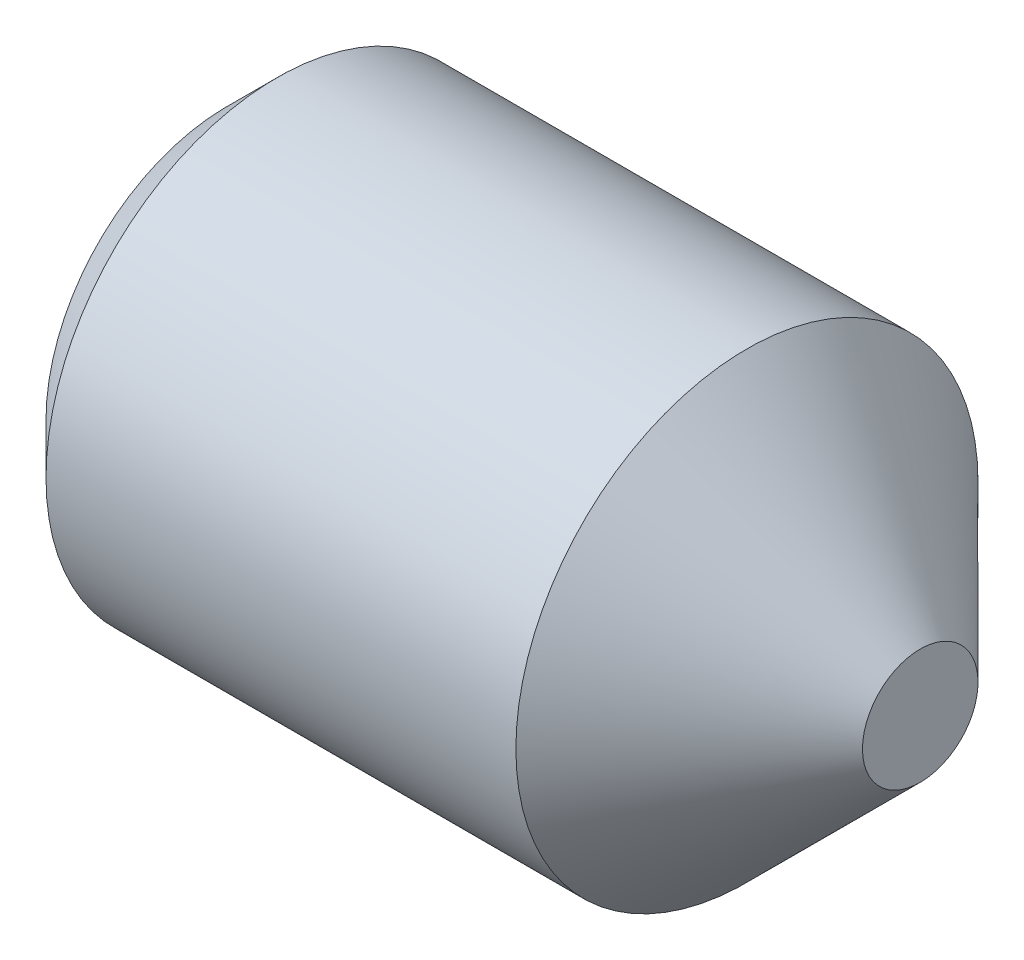
ISO-10303-21;
HEADER;
FILE_DESCRIPTION(('STEP AP214'),'2;1');
FILE_NAME('part.step','',(''),(''),'','','');
FILE_SCHEMA(('AUTOMOTIVE_DESIGN { 1 0 10303 214 1 1 1 1 }'));
ENDSEC;
DATA;
#1=APPLICATION_CONTEXT('core data for automotive mechanical design processes');
#2=APPLICATION_PROTOCOL_DEFINITION('international standard','automotive_design',2000,#1);
#3=PRODUCT_CONTEXT('',#1,'mechanical');
#4=PRODUCT('Part','Part','',(#3));
#5=PRODUCT_RELATED_PRODUCT_CATEGORY('part','',(#4));
#6=PRODUCT_DEFINITION_FORMATION('','',#4);
#7=PRODUCT_DEFINITION_CONTEXT('part definition',#1,'design');
#8=PRODUCT_DEFINITION('design','',#6,#7);
#9=PRODUCT_DEFINITION_SHAPE('','',#8);
#10=(LENGTH_UNIT() NAMED_UNIT(*) SI_UNIT(.MILLI.,.METRE.));
#11=(NAMED_UNIT(*) PLANE_ANGLE_UNIT() SI_UNIT($,.RADIAN.));
#12=(NAMED_UNIT(*) SI_UNIT($,.STERADIAN.) SOLID_ANGLE_UNIT());
#13=UNCERTAINTY_MEASURE_WITH_UNIT(LENGTH_MEASURE(1.E-05),#10,'distance_accuracy_value','');
#14=(GEOMETRIC_REPRESENTATION_CONTEXT(3) GLOBAL_UNCERTAINTY_ASSIGNED_CONTEXT((#13)) GLOBAL_UNIT_ASSIGNED_CONTEXT((#10,
#11,#12)) REPRESENTATION_CONTEXT('',''));
#15=CARTESIAN_POINT('',(0.,0.,0.));
#16=DIRECTION('',(0.,0.,1.));
#17=DIRECTION('',(1.,0.,0.));
#18=AXIS2_PLACEMENT_3D('',#15,#16,#17);
#19=CARTESIAN_POINT('',(0.799999999886313,0.,0.519615242270663));
#20=DIRECTION('',(-1.,0.,0.));
#21=DIRECTION('',(0.,0.,1.));
#22=AXIS2_PLACEMENT_3D('',#19,#20,#21);
#23=PLANE('',#22);
#24=DIRECTION('',(0.,0.,-1.));
#25=VECTOR('',#24,1.);
#26=CARTESIAN_POINT('',(0.799999999886313,0.45,0.259807621135332));
#27=LINE('',#26,#25);
#28=CARTESIAN_POINT('',(0.799999999886313,0.45,0.259807621135332));
#29=VERTEX_POINT('',#28);
#30=CARTESIAN_POINT('',(0.799999999886313,0.45,0.));
#31=VERTEX_POINT('',#30);
#32=EDGE_CURVE('E158',#29,#31,#27,.T.);
#33=ORIENTED_EDGE('',*,*,#32,.T.);
#34=CARTESIAN_POINT('',(0.799999999886313,0.,0.));
#35=DIRECTION('',(1.,0.,0.));
#36=DIRECTION('',(0.,1.,0.));
#37=AXIS2_PLACEMENT_3D('',#34,#35,#36);
#38=CIRCLE('',#37,0.45);
#39=CARTESIAN_POINT('',(0.799999999886313,0.225,0.389711431702997));
#40=VERTEX_POINT('',#39);
#41=EDGE_CURVE('E47',#31,#40,#38,.T.);
#42=ORIENTED_EDGE('',*,*,#41,.T.);
#43=DIRECTION('',(0.,0.866025403784438,-0.5));
#44=VECTOR('',#43,1.);
#45=CARTESIAN_POINT('',(0.799999999886313,0.,0.519615242270663));
#46=LINE('',#45,#44);
#47=EDGE_CURVE('E214',#40,#29,#46,.T.);
#48=ORIENTED_EDGE('',*,*,#47,.T.);
#49=EDGE_LOOP('',(#33,#42,#48));
#50=FACE_BOUND('',#49,.T.);
#51=ADVANCED_FACE('F36',(#50),#23,.T.);
#52=CARTESIAN_POINT('',(0.799999999886313,0.,0.519615242270663));
#53=VERTEX_POINT('',#52);
#54=EDGE_CURVE('E219',#53,#40,#46,.T.);
#55=ORIENTED_EDGE('',*,*,#54,.T.);
#56=CARTESIAN_POINT('',(0.799999999886313,-0.225,0.389711431702997));
#57=VERTEX_POINT('',#56);
#58=EDGE_CURVE('E11',#40,#57,#38,.T.);
#59=ORIENTED_EDGE('',*,*,#58,.T.);
#60=DIRECTION('',(0.,0.866025403784438,0.5));
#61=VECTOR('',#60,1.);
#62=CARTESIAN_POINT('',(0.799999999886313,-0.45,0.259807621135332));
#63=LINE('',#62,#61);
#64=EDGE_CURVE('E184',#57,#53,#63,.T.);
#65=ORIENTED_EDGE('',*,*,#64,.T.);
#66=EDGE_LOOP('',(#55,#59,#65));
#67=FACE_BOUND('',#66,.T.);
#68=ADVANCED_FACE('F123',(#67),#23,.T.);
#69=CARTESIAN_POINT('',(0.799999999886313,-0.45,0.259807621135332));
#70=VERTEX_POINT('',#69);
#71=EDGE_CURVE('E220',#70,#57,#63,.T.);
#72=ORIENTED_EDGE('',*,*,#71,.T.);
#73=CARTESIAN_POINT('',(0.799999999886313,-0.45,0.));
#74=VERTEX_POINT('',#73);
#75=EDGE_CURVE('E45',#57,#74,#38,.T.);
#76=ORIENTED_EDGE('',*,*,#75,.T.);
#77=DIRECTION('',(0.,0.,1.));
#78=VECTOR('',#77,1.);
#79=CARTESIAN_POINT('',(0.799999999886313,-0.45,-0.259807621135331));
#80=LINE('',#79,#78);
#81=EDGE_CURVE('E163',#74,#70,#80,.T.);
#82=ORIENTED_EDGE('',*,*,#81,.T.);
#83=EDGE_LOOP('',(#72,#76,#82));
#84=FACE_BOUND('',#83,.T.);
#85=ADVANCED_FACE('F129',(#84),#23,.T.);
#86=CARTESIAN_POINT('',(0.799999999886313,-0.45,-0.259807621135331));
#87=VERTEX_POINT('',#86);
#88=EDGE_CURVE('E164',#87,#74,#80,.T.);
#89=ORIENTED_EDGE('',*,*,#88,.T.);
#90=CARTESIAN_POINT('',(0.799999999886313,-0.225,-0.389711431702997));
#91=VERTEX_POINT('',#90);
#92=EDGE_CURVE('E211',#74,#91,#38,.T.);
#93=ORIENTED_EDGE('',*,*,#92,.T.);
#94=DIRECTION('',(0.,-0.866025403784439,0.5));
#95=VECTOR('',#94,1.);
#96=CARTESIAN_POINT('',(0.799999999886313,0.,-0.519615242270663));
#97=LINE('',#96,#95);
#98=EDGE_CURVE('E153',#91,#87,#97,.T.);
#99=ORIENTED_EDGE('',*,*,#98,.T.);
#100=EDGE_LOOP('',(#89,#93,#99));
#101=FACE_BOUND('',#100,.T.);
#102=ADVANCED_FACE('F142',(#101),#23,.T.);
#103=CARTESIAN_POINT('',(0.799999999886313,0.,-0.519615242270663));
#104=VERTEX_POINT('',#103);
#105=EDGE_CURVE('E156',#104,#91,#97,.T.);
#106=ORIENTED_EDGE('',*,*,#105,.T.);
#107=CARTESIAN_POINT('',(0.799999999886313,0.225,-0.389711431702997));
#108=VERTEX_POINT('',#107);
#109=EDGE_CURVE('E209',#91,#108,#38,.T.);
#110=ORIENTED_EDGE('',*,*,#109,.T.);
#111=DIRECTION('',(0.,-0.866025403784438,-0.5));
#112=VECTOR('',#111,1.);
#113=CARTESIAN_POINT('',(0.799999999886313,0.45,-0.259807621135332));
#114=LINE('',#113,#112);
#115=EDGE_CURVE('E154',#108,#104,#114,.T.);
#116=ORIENTED_EDGE('',*,*,#115,.T.);
#117=EDGE_LOOP('',(#106,#110,#116));
#118=FACE_BOUND('',#117,.T.);
#119=ADVANCED_FACE('F134',(#118),#23,.T.);
#120=CARTESIAN_POINT('',(0.799999999886313,0.45,-0.259807621135332));
#121=VERTEX_POINT('',#120);
#122=EDGE_CURVE('E146',#121,#108,#114,.T.);
#123=ORIENTED_EDGE('',*,*,#122,.T.);
#124=EDGE_CURVE('E147',#108,#31,#38,.T.);
#125=ORIENTED_EDGE('',*,*,#124,.T.);
#126=EDGE_CURVE('E149',#31,#121,#27,.T.);
#127=ORIENTED_EDGE('',*,*,#126,.T.);
#128=EDGE_LOOP('',(#123,#125,#127));
#129=FACE_BOUND('',#128,.T.);
#130=ADVANCED_FACE('F125',(#129),#23,.T.);
#131=CARTESIAN_POINT('',(0.,0.7835,0.));
#132=DIRECTION('',(1.,0.,0.));
#133=DIRECTION('',(0.,0.,-1.));
#134=AXIS2_PLACEMENT_3D('',#131,#132,#133);
#135=PLANE('',#134);
#136=DIRECTION('',(0.,0.866025403784438,-0.5));
#137=VECTOR('',#136,1.);
#138=CARTESIAN_POINT('',(-1.13686837721616E-10,0.,0.519615242270663));
#139=LINE('',#138,#137);
#140=CARTESIAN_POINT('',(0.,0.,0.519615242270663));
#141=VERTEX_POINT('',#140);
#142=CARTESIAN_POINT('',(-1.13686837721616E-10,0.45,0.259807621135332));
#143=VERTEX_POINT('',#142);
#144=EDGE_CURVE('E169',#141,#143,#139,.T.);
#145=ORIENTED_EDGE('',*,*,#144,.F.);
#146=DIRECTION('',(0.,0.866025403784438,0.5));
#147=VECTOR('',#146,1.);
#148=CARTESIAN_POINT('',(-1.13686837721616E-10,-0.45,0.259807621135332));
#149=LINE('',#148,#147);
#150=CARTESIAN_POINT('',(-1.13686837721616E-10,-0.45,0.259807621135332));
#151=VERTEX_POINT('',#150);
#152=EDGE_CURVE('E61',#151,#141,#149,.T.);
#153=ORIENTED_EDGE('',*,*,#152,.F.);
#154=DIRECTION('',(0.,0.,1.));
#155=VECTOR('',#154,1.);
#156=CARTESIAN_POINT('',(-1.13686837721616E-10,-0.45,-0.259807621135331));
#157=LINE('',#156,#155);
#158=CARTESIAN_POINT('',(-1.13686837721616E-10,-0.45,-0.259807621135331));
#159=VERTEX_POINT('',#158);
#160=EDGE_CURVE('E181',#159,#151,#157,.T.);
#161=ORIENTED_EDGE('',*,*,#160,.F.);
#162=DIRECTION('',(0.,-0.866025403784439,0.5));
#163=VECTOR('',#162,1.);
#164=CARTESIAN_POINT('',(-1.13686837721616E-10,0.,-0.519615242270663));
#165=LINE('',#164,#163);
#166=CARTESIAN_POINT('',(-1.13686837721616E-10,0.,-0.519615242270663));
#167=VERTEX_POINT('',#166);
#168=EDGE_CURVE('E178',#167,#159,#165,.T.);
#169=ORIENTED_EDGE('',*,*,#168,.F.);
#170=DIRECTION('',(0.,-0.866025403784438,-0.5));
#171=VECTOR('',#170,1.);
#172=CARTESIAN_POINT('',(-1.13686837721616E-10,0.45,-0.259807621135332));
#173=LINE('',#172,#171);
#174=CARTESIAN_POINT('',(-1.13686837721616E-10,0.45,-0.259807621135332));
#175=VERTEX_POINT('',#174);
#176=EDGE_CURVE('E175',#175,#167,#173,.T.);
#177=ORIENTED_EDGE('',*,*,#176,.F.);
#178=DIRECTION('',(0.,0.,-1.));
#179=VECTOR('',#178,1.);
#180=CARTESIAN_POINT('',(-1.13686837721616E-10,0.45,0.259807621135332));
#181=LINE('',#180,#179);
#182=EDGE_CURVE('E172',#143,#175,#181,.T.);
#183=ORIENTED_EDGE('',*,*,#182,.F.);
#184=EDGE_LOOP('',(#145,#153,#161,#169,#177,#183));
#185=FACE_BOUND('',#184,.T.);
#186=CARTESIAN_POINT('',(0.,0.,0.));
#187=DIRECTION('',(-1.,0.,0.));
#188=DIRECTION('',(0.,0.,1.));
#189=AXIS2_PLACEMENT_3D('',#186,#187,#188);
#190=CIRCLE('',#189,0.7835);
#191=CARTESIAN_POINT('',(0.,0.,0.7835));
#192=VERTEX_POINT('',#191);
#193=EDGE_CURVE('E187',#192,#192,#190,.T.);
#194=ORIENTED_EDGE('',*,*,#193,.T.);
#195=EDGE_LOOP('',(#194));
#196=FACE_BOUND('',#195,.T.);
#197=ADVANCED_FACE('F38',(#185,#196),#135,.F.);
#198=CARTESIAN_POINT('',(3.,0.,0.));
#199=DIRECTION('',(-1.,0.,0.));
#200=DIRECTION('',(0.,0.,1.));
#201=AXIS2_PLACEMENT_3D('',#198,#199,#200);
#202=PLANE('',#201);
#203=CARTESIAN_POINT('',(3.,0.,0.));
#204=DIRECTION('',(-1.,0.,0.));
#205=DIRECTION('',(0.,0.,1.));
#206=AXIS2_PLACEMENT_3D('',#203,#204,#205);
#207=CIRCLE('',#206,0.25);
#208=CARTESIAN_POINT('',(3.,0.,0.25));
#209=VERTEX_POINT('',#208);
#210=EDGE_CURVE('E40',#209,#209,#207,.T.);
#211=ORIENTED_EDGE('',*,*,#210,.F.);
#212=EDGE_LOOP('',(#211));
#213=FACE_BOUND('',#212,.T.);
#214=ADVANCED_FACE('F140',(#213),#202,.F.);
#215=CARTESIAN_POINT('',(3.,0.,0.));
#216=DIRECTION('',(-1.,0.,0.));
#217=DIRECTION('',(0.,0.,1.));
#218=AXIS2_PLACEMENT_3D('',#215,#216,#217);
#219=CONICAL_SURFACE('',#218,0.25,0.785398163397443);
#220=CARTESIAN_POINT('',(2.24999999999999,0.,0.));
#221=DIRECTION('',(-1.,0.,0.));
#222=DIRECTION('',(0.,0.,1.));
#223=AXIS2_PLACEMENT_3D('',#220,#221,#222);
#224=CIRCLE('',#223,1.);
#225=CARTESIAN_POINT('',(2.24999999999999,0.,1.));
#226=VERTEX_POINT('',#225);
#227=EDGE_CURVE('E202',#226,#226,#224,.T.);
#228=ORIENTED_EDGE('',*,*,#227,.F.);
#229=EDGE_LOOP('',(#228));
#230=FACE_BOUND('',#229,.T.);
#231=ORIENTED_EDGE('',*,*,#210,.T.);
#232=EDGE_LOOP('',(#231));
#233=FACE_BOUND('',#232,.T.);
#234=ADVANCED_FACE('F267',(#230,#233),#219,.T.);
#235=CARTESIAN_POINT('',(-14.774129749189,0.,0.));
#236=DIRECTION('',(-1.,0.,0.));
#237=DIRECTION('',(0.,0.,1.));
#238=AXIS2_PLACEMENT_3D('',#235,#236,#237);
#239=CYLINDRICAL_SURFACE('',#238,1.);
#240=CARTESIAN_POINT('',(0.216500000000001,0.,0.));
#241=DIRECTION('',(-1.,0.,0.));
#242=DIRECTION('',(0.,0.,1.));
#243=AXIS2_PLACEMENT_3D('',#240,#241,#242);
#244=CIRCLE('',#243,1.);
#245=CARTESIAN_POINT('',(0.216500000000001,0.,1.));
#246=VERTEX_POINT('',#245);
#247=EDGE_CURVE('E200',#246,#246,#244,.T.);
#248=ORIENTED_EDGE('',*,*,#247,.F.);
#249=EDGE_LOOP('',(#248));
#250=FACE_BOUND('',#249,.T.);
#251=ORIENTED_EDGE('',*,*,#227,.T.);
#252=EDGE_LOOP('',(#251));
#253=FACE_BOUND('',#252,.T.);
#254=ADVANCED_FACE('F263',(#250,#253),#239,.T.);
#255=CARTESIAN_POINT('',(0.216500000000001,0.,0.));
#256=DIRECTION('',(1.,0.,0.));
#257=DIRECTION('',(0.,0.,-1.));
#258=AXIS2_PLACEMENT_3D('',#255,#256,#257);
#259=CONICAL_SURFACE('',#258,1.,0.785398163397445);
#260=ORIENTED_EDGE('',*,*,#193,.F.);
#261=EDGE_LOOP('',(#260));
#262=FACE_BOUND('',#261,.T.);
#263=ORIENTED_EDGE('',*,*,#247,.T.);
#264=EDGE_LOOP('',(#263));
#265=FACE_BOUND('',#264,.T.);
#266=ADVANCED_FACE('F254',(#262,#265),#259,.T.);
#267=CARTESIAN_POINT('',(0.799999999886313,-0.45,0.259807621135332));
#268=DIRECTION('',(0.,-0.5,0.866025403784438));
#269=DIRECTION('',(0.,-0.866025403784439,-0.5));
#270=AXIS2_PLACEMENT_3D('',#267,#268,#269);
#271=PLANE('',#270);
#272=ORIENTED_EDGE('',*,*,#152,.T.);
#273=DIRECTION('',(-1.,0.,0.));
#274=VECTOR('',#273,1.);
#275=CARTESIAN_POINT('',(0.799999999886313,0.,0.519615242270663));
#276=LINE('',#275,#274);
#277=EDGE_CURVE('E167',#53,#141,#276,.T.);
#278=ORIENTED_EDGE('',*,*,#277,.F.);
#279=ORIENTED_EDGE('',*,*,#64,.F.);
#280=ORIENTED_EDGE('',*,*,#71,.F.);
#281=DIRECTION('',(-1.,0.,0.));
#282=VECTOR('',#281,1.);
#283=CARTESIAN_POINT('',(0.799999999886313,-0.45,0.259807621135332));
#284=LINE('',#283,#282);
#285=EDGE_CURVE('E185',#70,#151,#284,.T.);
#286=ORIENTED_EDGE('',*,*,#285,.T.);
#287=EDGE_LOOP('',(#272,#278,#279,#280,#286));
#288=FACE_BOUND('',#287,.T.);
#289=ADVANCED_FACE('F228',(#288),#271,.F.);
#290=CARTESIAN_POINT('',(0.799999999886313,-0.45,-0.259807621135331));
#291=DIRECTION('',(0.,-1.,0.));
#292=DIRECTION('',(0.,0.,-1.));
#293=AXIS2_PLACEMENT_3D('',#290,#291,#292);
#294=PLANE('',#293);
#295=ORIENTED_EDGE('',*,*,#160,.T.);
#296=ORIENTED_EDGE('',*,*,#285,.F.);
#297=ORIENTED_EDGE('',*,*,#81,.F.);
#298=ORIENTED_EDGE('',*,*,#88,.F.);
#299=DIRECTION('',(-1.,0.,0.));
#300=VECTOR('',#299,1.);
#301=CARTESIAN_POINT('',(0.799999999886313,-0.45,-0.259807621135331));
#302=LINE('',#301,#300);
#303=EDGE_CURVE('E188',#87,#159,#302,.T.);
#304=ORIENTED_EDGE('',*,*,#303,.T.);
#305=EDGE_LOOP('',(#295,#296,#297,#298,#304));
#306=FACE_BOUND('',#305,.T.);
#307=ADVANCED_FACE('F247',(#306),#294,.F.);
#308=CARTESIAN_POINT('',(0.799999999886313,0.,-0.519615242270663));
#309=DIRECTION('',(0.,-0.5,-0.866025403784439));
#310=DIRECTION('',(0.,0.866025403784439,-0.5));
#311=AXIS2_PLACEMENT_3D('',#308,#309,#310);
#312=PLANE('',#311);
#313=ORIENTED_EDGE('',*,*,#168,.T.);
#314=ORIENTED_EDGE('',*,*,#303,.F.);
#315=ORIENTED_EDGE('',*,*,#98,.F.);
#316=ORIENTED_EDGE('',*,*,#105,.F.);
#317=DIRECTION('',(-1.,0.,0.));
#318=VECTOR('',#317,1.);
#319=CARTESIAN_POINT('',(0.799999999886313,0.,-0.519615242270663));
#320=LINE('',#319,#318);
#321=EDGE_CURVE('E190',#104,#167,#320,.T.);
#322=ORIENTED_EDGE('',*,*,#321,.T.);
#323=EDGE_LOOP('',(#313,#314,#315,#316,#322));
#324=FACE_BOUND('',#323,.T.);
#325=ADVANCED_FACE('F241',(#324),#312,.F.);
#326=CARTESIAN_POINT('',(0.799999999886313,0.45,-0.259807621135332));
#327=DIRECTION('',(0.,0.5,-0.866025403784438));
#328=DIRECTION('',(0.,0.866025403784439,0.5));
#329=AXIS2_PLACEMENT_3D('',#326,#327,#328);
#330=PLANE('',#329);
#331=ORIENTED_EDGE('',*,*,#176,.T.);
#332=ORIENTED_EDGE('',*,*,#321,.F.);
#333=ORIENTED_EDGE('',*,*,#115,.F.);
#334=ORIENTED_EDGE('',*,*,#122,.F.);
#335=DIRECTION('',(-1.,0.,0.));
#336=VECTOR('',#335,1.);
#337=CARTESIAN_POINT('',(0.799999999886313,0.45,-0.259807621135332));
#338=LINE('',#337,#336);
#339=EDGE_CURVE('E192',#121,#175,#338,.T.);
#340=ORIENTED_EDGE('',*,*,#339,.T.);
#341=EDGE_LOOP('',(#331,#332,#333,#334,#340));
#342=FACE_BOUND('',#341,.T.);
#343=ADVANCED_FACE('F236',(#342),#330,.F.);
#344=CARTESIAN_POINT('',(0.799999999886313,0.45,0.259807621135332));
#345=DIRECTION('',(0.,1.,0.));
#346=DIRECTION('',(0.,0.,1.));
#347=AXIS2_PLACEMENT_3D('',#344,#345,#346);
#348=PLANE('',#347);
#349=ORIENTED_EDGE('',*,*,#182,.T.);
#350=ORIENTED_EDGE('',*,*,#339,.F.);
#351=ORIENTED_EDGE('',*,*,#126,.F.);
#352=ORIENTED_EDGE('',*,*,#32,.F.);
#353=DIRECTION('',(-1.,0.,0.));
#354=VECTOR('',#353,1.);
#355=CARTESIAN_POINT('',(0.799999999886313,0.45,0.259807621135332));
#356=LINE('',#355,#354);
#357=EDGE_CURVE('E194',#29,#143,#356,.T.);
#358=ORIENTED_EDGE('',*,*,#357,.T.);
#359=EDGE_LOOP('',(#349,#350,#351,#352,#358));
#360=FACE_BOUND('',#359,.T.);
#361=ADVANCED_FACE('F118',(#360),#348,.F.);
#362=CARTESIAN_POINT('',(0.799999999886313,0.,0.519615242270663));
#363=DIRECTION('',(0.,0.5,0.866025403784438));
#364=DIRECTION('',(0.,-0.866025403784438,0.5));
#365=AXIS2_PLACEMENT_3D('',#362,#363,#364);
#366=PLANE('',#365);
#367=ORIENTED_EDGE('',*,*,#144,.T.);
#368=ORIENTED_EDGE('',*,*,#357,.F.);
#369=ORIENTED_EDGE('',*,*,#47,.F.);
#370=ORIENTED_EDGE('',*,*,#54,.F.);
#371=ORIENTED_EDGE('',*,*,#277,.T.);
#372=EDGE_LOOP('',(#367,#368,#369,#370,#371));
#373=FACE_BOUND('',#372,.T.);
#374=ADVANCED_FACE('F113',(#373),#366,.F.);
#375=CARTESIAN_POINT('',(1.05980762102165,0.,0.));
#376=DIRECTION('',(-1.,0.,0.));
#377=DIRECTION('',(0.,-1.,0.));
#378=AXIS2_PLACEMENT_3D('',#375,#376,#377);
#379=CONICAL_SURFACE('',#378,0.,1.0471975511966);
#380=ORIENTED_EDGE('',*,*,#41,.F.);
#381=ORIENTED_EDGE('',*,*,#124,.F.);
#382=ORIENTED_EDGE('',*,*,#109,.F.);
#383=ORIENTED_EDGE('',*,*,#92,.F.);
#384=ORIENTED_EDGE('',*,*,#75,.F.);
#385=ORIENTED_EDGE('',*,*,#58,.F.);
#386=EDGE_LOOP('',(#380,#381,#382,#383,#384,#385));
#387=FACE_BOUND('',#386,.T.);
#388=CARTESIAN_POINT('',(1.05980762102165,0.,0.));
#389=VERTEX_POINT('',#388);
#390=VERTEX_LOOP('',#389);
#391=FACE_BOUND('',#390,.T.);
#392=ADVANCED_FACE('F111',(#387,#391),#379,.F.);
#393=CLOSED_SHELL('',(#51,#68,#85,#102,#119,#130,#197,#214,#234,#254,#266,#289,#307,#325,#343,
#361,#374,#392));
#394=MANIFOLD_SOLID_BREP('B2',#393);
#395=ADVANCED_BREP_SHAPE_REPRESENTATION('',(#18,#394),#14);
#396=SHAPE_DEFINITION_REPRESENTATION(#9,#395);
ENDSEC;
END-ISO-10303-21;
